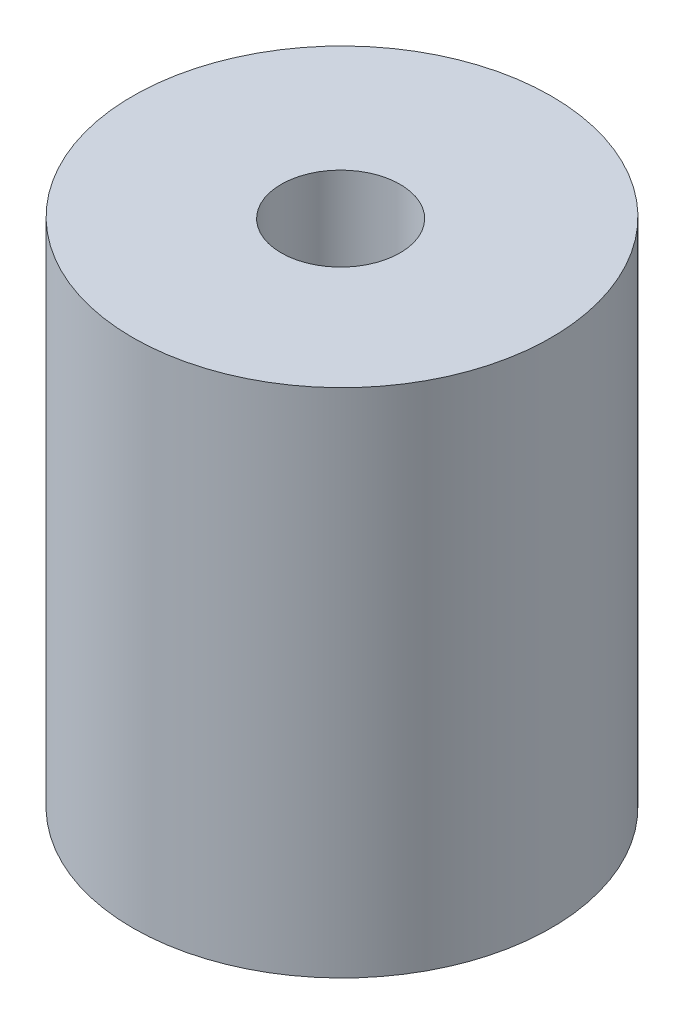
ISO-10303-21;
HEADER;
FILE_DESCRIPTION(('STEP AP214'),'2;1');
FILE_NAME('part.step','',(''),(''),'','','');
FILE_SCHEMA(('AUTOMOTIVE_DESIGN { 1 0 10303 214 1 1 1 1 }'));
ENDSEC;
DATA;
#1=APPLICATION_CONTEXT('core data for automotive mechanical design processes');
#2=APPLICATION_PROTOCOL_DEFINITION('international standard','automotive_design',2000,#1);
#3=PRODUCT_CONTEXT('',#1,'mechanical');
#4=PRODUCT('Part','Part','',(#3));
#5=PRODUCT_RELATED_PRODUCT_CATEGORY('part','',(#4));
#6=PRODUCT_DEFINITION_FORMATION('','',#4);
#7=PRODUCT_DEFINITION_CONTEXT('part definition',#1,'design');
#8=PRODUCT_DEFINITION('design','',#6,#7);
#9=PRODUCT_DEFINITION_SHAPE('','',#8);
#10=(LENGTH_UNIT() NAMED_UNIT(*) SI_UNIT(.MILLI.,.METRE.));
#11=(NAMED_UNIT(*) PLANE_ANGLE_UNIT() SI_UNIT($,.RADIAN.));
#12=(NAMED_UNIT(*) SI_UNIT($,.STERADIAN.) SOLID_ANGLE_UNIT());
#13=UNCERTAINTY_MEASURE_WITH_UNIT(LENGTH_MEASURE(1.E-05),#10,'distance_accuracy_value','');
#14=(GEOMETRIC_REPRESENTATION_CONTEXT(3) GLOBAL_UNCERTAINTY_ASSIGNED_CONTEXT((#13)) GLOBAL_UNIT_ASSIGNED_CONTEXT((#10,
#11,#12)) REPRESENTATION_CONTEXT('',''));
#15=CARTESIAN_POINT('',(0.,0.,0.));
#16=DIRECTION('',(0.,0.,1.));
#17=DIRECTION('',(1.,0.,0.));
#18=AXIS2_PLACEMENT_3D('',#15,#16,#17);
#19=CARTESIAN_POINT('',(-10.5852136687056,54.61,-13.3707962131019));
#20=DIRECTION('',(0.,-1.,0.));
#21=DIRECTION('',(0.,0.,-1.));
#22=AXIS2_PLACEMENT_3D('',#19,#20,#21);
#23=CYLINDRICAL_SURFACE('',#22,22.352);
#24=CARTESIAN_POINT('',(-10.5852136687056,54.61,-13.3707962131019));
#25=DIRECTION('',(0.,1.,0.));
#26=DIRECTION('',(0.,0.,1.));
#27=AXIS2_PLACEMENT_3D('',#24,#25,#26);
#28=CIRCLE('',#27,22.352);
#29=CARTESIAN_POINT('',(-10.5852136687056,54.61,8.98120378689814));
#30=VERTEX_POINT('',#29);
#31=EDGE_CURVE('E10',#30,#30,#28,.T.);
#32=ORIENTED_EDGE('',*,*,#31,.F.);
#33=EDGE_LOOP('',(#32));
#34=FACE_BOUND('',#33,.T.);
#35=CARTESIAN_POINT('',(-10.5852136687056,0.,-13.3707962131019));
#36=DIRECTION('',(0.,1.,0.));
#37=DIRECTION('',(0.,0.,1.));
#38=AXIS2_PLACEMENT_3D('',#35,#36,#37);
#39=CIRCLE('',#38,22.352);
#40=CARTESIAN_POINT('',(-10.5852136687056,0.,8.98120378689814));
#41=VERTEX_POINT('',#40);
#42=EDGE_CURVE('E33',#41,#41,#39,.T.);
#43=ORIENTED_EDGE('',*,*,#42,.T.);
#44=EDGE_LOOP('',(#43));
#45=FACE_BOUND('',#44,.T.);
#46=ADVANCED_FACE('F30',(#34,#45),#23,.T.);
#47=CARTESIAN_POINT('',(-10.5852136687056,54.61,-13.3707962131019));
#48=DIRECTION('',(0.,1.,0.));
#49=DIRECTION('',(0.,0.,1.));
#50=AXIS2_PLACEMENT_3D('',#47,#48,#49);
#51=PLANE('',#50);
#52=CARTESIAN_POINT('',(-10.493492602,54.61,-13.133399692));
#53=DIRECTION('',(0.,1.,0.));
#54=DIRECTION('',(0.,0.,1.));
#55=AXIS2_PLACEMENT_3D('',#52,#53,#54);
#56=CIRCLE('',#55,6.35);
#57=CARTESIAN_POINT('',(-10.493492602,54.61,-6.783399692));
#58=VERTEX_POINT('',#57);
#59=EDGE_CURVE('E42',#58,#58,#56,.T.);
#60=ORIENTED_EDGE('',*,*,#59,.F.);
#61=EDGE_LOOP('',(#60));
#62=FACE_BOUND('',#61,.T.);
#63=ORIENTED_EDGE('',*,*,#31,.T.);
#64=EDGE_LOOP('',(#63));
#65=FACE_BOUND('',#64,.T.);
#66=ADVANCED_FACE('F67',(#62,#65),#51,.T.);
#67=CARTESIAN_POINT('',(-10.5852136687056,0.,-13.3707962131019));
#68=DIRECTION('',(0.,1.,0.));
#69=DIRECTION('',(0.,0.,1.));
#70=AXIS2_PLACEMENT_3D('',#67,#68,#69);
#71=PLANE('',#70);
#72=CARTESIAN_POINT('',(-10.4934926782,0.,-13.133399692));
#73=DIRECTION('',(0.,-1.,0.));
#74=DIRECTION('',(0.,0.,-1.));
#75=AXIS2_PLACEMENT_3D('',#72,#73,#74);
#76=CIRCLE('',#75,6.35);
#77=CARTESIAN_POINT('',(-10.4934926782,0.,-19.483399692));
#78=VERTEX_POINT('',#77);
#79=EDGE_CURVE('E48',#78,#78,#76,.T.);
#80=ORIENTED_EDGE('',*,*,#79,.F.);
#81=EDGE_LOOP('',(#80));
#82=FACE_BOUND('',#81,.T.);
#83=ORIENTED_EDGE('',*,*,#42,.F.);
#84=EDGE_LOOP('',(#83));
#85=FACE_BOUND('',#84,.T.);
#86=ADVANCED_FACE('F63',(#82,#85),#71,.F.);
#87=CARTESIAN_POINT('',(-10.493492602,33.9598,-13.133399692));
#88=DIRECTION('',(0.,1.,0.));
#89=DIRECTION('',(0.,0.,1.));
#90=AXIS2_PLACEMENT_3D('',#87,#88,#89);
#91=CYLINDRICAL_SURFACE('',#90,6.35);
#92=CARTESIAN_POINT('',(-10.493492602,33.9598,-13.133399692));
#93=DIRECTION('',(0.,1.,0.));
#94=DIRECTION('',(0.,0.,1.));
#95=AXIS2_PLACEMENT_3D('',#92,#93,#94);
#96=CIRCLE('',#95,6.35);
#97=CARTESIAN_POINT('',(-10.493492602,33.9598,-6.783399692));
#98=VERTEX_POINT('',#97);
#99=EDGE_CURVE('E40',#98,#98,#96,.T.);
#100=ORIENTED_EDGE('',*,*,#99,.F.);
#101=EDGE_LOOP('',(#100));
#102=FACE_BOUND('',#101,.T.);
#103=ORIENTED_EDGE('',*,*,#59,.T.);
#104=EDGE_LOOP('',(#103));
#105=FACE_BOUND('',#104,.T.);
#106=ADVANCED_FACE('F66',(#102,#105),#91,.F.);
#107=CARTESIAN_POINT('',(-10.493492602,33.9598,-13.133399692));
#108=DIRECTION('',(0.,1.,0.));
#109=DIRECTION('',(0.,0.,1.));
#110=AXIS2_PLACEMENT_3D('',#107,#108,#109);
#111=PLANE('',#110);
#112=ORIENTED_EDGE('',*,*,#99,.T.);
#113=EDGE_LOOP('',(#112));
#114=FACE_BOUND('',#113,.T.);
#115=ADVANCED_FACE('F59',(#114),#111,.T.);
#116=CARTESIAN_POINT('',(-10.4934926782,20.6502,-13.133399692));
#117=DIRECTION('',(0.,-1.,0.));
#118=DIRECTION('',(0.,0.,-1.));
#119=AXIS2_PLACEMENT_3D('',#116,#117,#118);
#120=CYLINDRICAL_SURFACE('',#119,6.35);
#121=CARTESIAN_POINT('',(-10.4934926782,20.6502,-13.133399692));
#122=DIRECTION('',(0.,-1.,0.));
#123=DIRECTION('',(0.,0.,-1.));
#124=AXIS2_PLACEMENT_3D('',#121,#122,#123);
#125=CIRCLE('',#124,6.35);
#126=CARTESIAN_POINT('',(-10.4934926782,20.6502,-19.483399692));
#127=VERTEX_POINT('',#126);
#128=EDGE_CURVE('E45',#127,#127,#125,.T.);
#129=ORIENTED_EDGE('',*,*,#128,.F.);
#130=EDGE_LOOP('',(#129));
#131=FACE_BOUND('',#130,.T.);
#132=ORIENTED_EDGE('',*,*,#79,.T.);
#133=EDGE_LOOP('',(#132));
#134=FACE_BOUND('',#133,.T.);
#135=ADVANCED_FACE('F56',(#131,#134),#120,.F.);
#136=CARTESIAN_POINT('',(-10.4934926782,20.6502,-13.133399692));
#137=DIRECTION('',(0.,-1.,0.));
#138=DIRECTION('',(0.,0.,-1.));
#139=AXIS2_PLACEMENT_3D('',#136,#137,#138);
#140=PLANE('',#139);
#141=ORIENTED_EDGE('',*,*,#128,.T.);
#142=EDGE_LOOP('',(#141));
#143=FACE_BOUND('',#142,.T.);
#144=ADVANCED_FACE('F54',(#143),#140,.T.);
#145=CLOSED_SHELL('',(#46,#66,#86,#106,#115,#135,#144));
#146=MANIFOLD_SOLID_BREP('B2',#145);
#147=ADVANCED_BREP_SHAPE_REPRESENTATION('',(#18,#146),#14);
#148=SHAPE_DEFINITION_REPRESENTATION(#9,#147);
ENDSEC;
END-ISO-10303-21;
